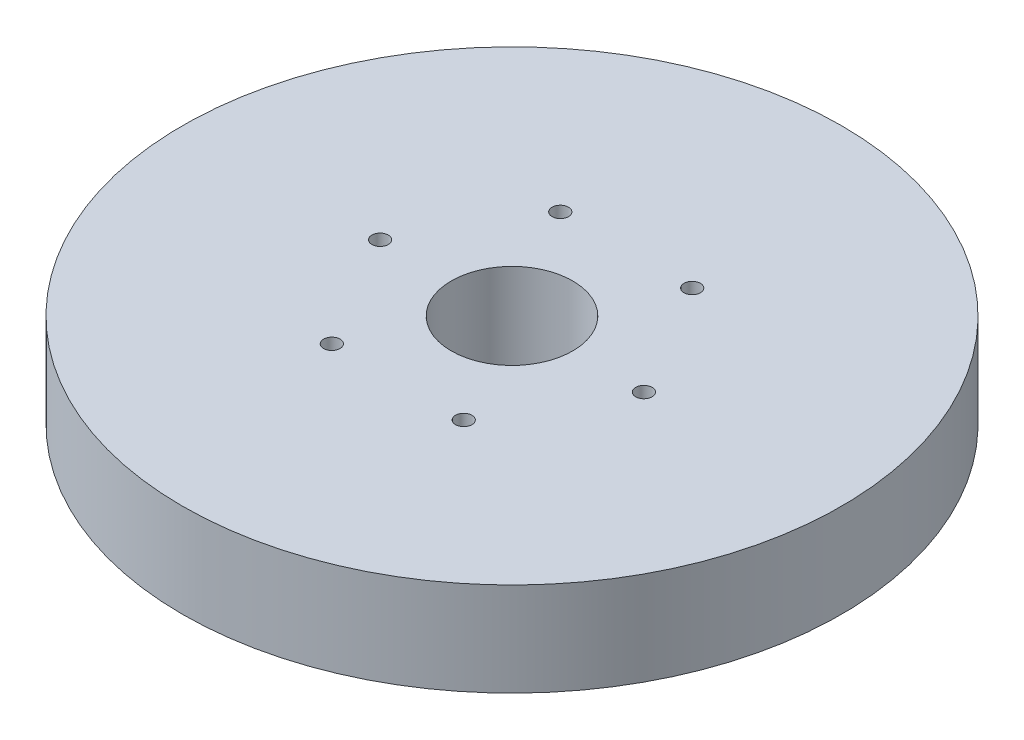
ISO-10303-21;
HEADER;
FILE_DESCRIPTION(('STEP AP214'),'2;1');
FILE_NAME('part.step','',(''),(''),'','','');
FILE_SCHEMA(('AUTOMOTIVE_DESIGN { 1 0 10303 214 1 1 1 1 }'));
ENDSEC;
DATA;
#1=APPLICATION_CONTEXT('core data for automotive mechanical design processes');
#2=APPLICATION_PROTOCOL_DEFINITION('international standard','automotive_design',2000,#1);
#3=PRODUCT_CONTEXT('',#1,'mechanical');
#4=PRODUCT('Part','Part','',(#3));
#5=PRODUCT_RELATED_PRODUCT_CATEGORY('part','',(#4));
#6=PRODUCT_DEFINITION_FORMATION('','',#4);
#7=PRODUCT_DEFINITION_CONTEXT('part definition',#1,'design');
#8=PRODUCT_DEFINITION('design','',#6,#7);
#9=PRODUCT_DEFINITION_SHAPE('','',#8);
#10=(LENGTH_UNIT() NAMED_UNIT(*) SI_UNIT(.MILLI.,.METRE.));
#11=(NAMED_UNIT(*) PLANE_ANGLE_UNIT() SI_UNIT($,.RADIAN.));
#12=(NAMED_UNIT(*) SI_UNIT($,.STERADIAN.) SOLID_ANGLE_UNIT());
#13=UNCERTAINTY_MEASURE_WITH_UNIT(LENGTH_MEASURE(1.E-05),#10,'distance_accuracy_value','');
#14=(GEOMETRIC_REPRESENTATION_CONTEXT(3) GLOBAL_UNCERTAINTY_ASSIGNED_CONTEXT((#13)) GLOBAL_UNIT_ASSIGNED_CONTEXT((#10,
#11,#12)) REPRESENTATION_CONTEXT('',''));
#15=CARTESIAN_POINT('',(0.,0.,0.));
#16=DIRECTION('',(0.,0.,1.));
#17=DIRECTION('',(1.,0.,0.));
#18=AXIS2_PLACEMENT_3D('',#15,#16,#17);
#19=CARTESIAN_POINT('',(0.,27.,0.));
#20=DIRECTION('',(0.,-1.,0.));
#21=DIRECTION('',(0.,0.,-1.));
#22=AXIS2_PLACEMENT_3D('',#19,#20,#21);
#23=CYLINDRICAL_SURFACE('',#22,95.);
#24=CARTESIAN_POINT('',(0.,27.,0.));
#25=DIRECTION('',(0.,1.,0.));
#26=DIRECTION('',(0.,0.,1.));
#27=AXIS2_PLACEMENT_3D('',#24,#25,#26);
#28=CIRCLE('',#27,95.);
#29=CARTESIAN_POINT('',(0.,27.,95.));
#30=VERTEX_POINT('',#29);
#31=EDGE_CURVE('E10',#30,#30,#28,.T.);
#32=ORIENTED_EDGE('',*,*,#31,.F.);
#33=EDGE_LOOP('',(#32));
#34=FACE_BOUND('',#33,.T.);
#35=CARTESIAN_POINT('',(0.,0.,0.));
#36=DIRECTION('',(0.,1.,0.));
#37=DIRECTION('',(0.,0.,1.));
#38=AXIS2_PLACEMENT_3D('',#35,#36,#37);
#39=CIRCLE('',#38,95.);
#40=CARTESIAN_POINT('',(0.,0.,95.));
#41=VERTEX_POINT('',#40);
#42=EDGE_CURVE('E37',#41,#41,#39,.T.);
#43=ORIENTED_EDGE('',*,*,#42,.T.);
#44=EDGE_LOOP('',(#43));
#45=FACE_BOUND('',#44,.T.);
#46=ADVANCED_FACE('F40',(#34,#45),#23,.T.);
#47=CARTESIAN_POINT('',(0.,27.,0.));
#48=DIRECTION('',(0.,1.,0.));
#49=DIRECTION('',(0.,0.,1.));
#50=AXIS2_PLACEMENT_3D('',#47,#48,#49);
#51=PLANE('',#50);
#52=CARTESIAN_POINT('',(-19.0119397928966,27.,-32.9296456717365));
#53=DIRECTION('',(0.,1.,0.));
#54=DIRECTION('',(-0.866025403784433,0.,0.50000000000001));
#55=AXIS2_PLACEMENT_3D('',#52,#53,#54);
#56=CIRCLE('',#55,2.36850058728825);
#57=CARTESIAN_POINT('',(-21.0631214703665,27.,-31.7453953780923));
#58=VERTEX_POINT('',#57);
#59=EDGE_CURVE('E70',#58,#58,#56,.T.);
#60=ORIENTED_EDGE('',*,*,#59,.F.);
#61=EDGE_LOOP('',(#60));
#62=FACE_BOUND('',#61,.T.);
#63=CARTESIAN_POINT('',(19.0119397928959,27.,-32.9296456717369));
#64=DIRECTION('',(0.,1.,0.));
#65=DIRECTION('',(-0.866025403784443,0.,-0.499999999999992));
#66=AXIS2_PLACEMENT_3D('',#63,#64,#65);
#67=CIRCLE('',#66,2.36850058728825);
#68=CARTESIAN_POINT('',(16.9607581154259,27.,-34.113895965381));
#69=VERTEX_POINT('',#68);
#70=EDGE_CURVE('E71',#69,#69,#67,.T.);
#71=ORIENTED_EDGE('',*,*,#70,.F.);
#72=EDGE_LOOP('',(#71));
#73=FACE_BOUND('',#72,.T.);
#74=CARTESIAN_POINT('',(38.0238795857924,27.,0.));
#75=DIRECTION('',(0.,1.,0.));
#76=DIRECTION('',(0.,0.,-1.));
#77=AXIS2_PLACEMENT_3D('',#74,#75,#76);
#78=CIRCLE('',#77,2.36850058728825);
#79=CARTESIAN_POINT('',(38.0238795857924,27.,-2.36850058728825));
#80=VERTEX_POINT('',#79);
#81=EDGE_CURVE('E78',#80,#80,#78,.T.);
#82=ORIENTED_EDGE('',*,*,#81,.F.);
#83=EDGE_LOOP('',(#82));
#84=FACE_BOUND('',#83,.T.);
#85=CARTESIAN_POINT('',(19.0119397928963,27.,32.9296456717366));
#86=DIRECTION('',(0.,1.,0.));
#87=DIRECTION('',(0.866025403784436,0.,-0.500000000000004));
#88=AXIS2_PLACEMENT_3D('',#85,#86,#87);
#89=CIRCLE('',#88,2.36850058728825);
#90=CARTESIAN_POINT('',(21.0631214703663,27.,31.7453953780925));
#91=VERTEX_POINT('',#90);
#92=EDGE_CURVE('E84',#91,#91,#89,.T.);
#93=ORIENTED_EDGE('',*,*,#92,.F.);
#94=EDGE_LOOP('',(#93));
#95=FACE_BOUND('',#94,.T.);
#96=CARTESIAN_POINT('',(-19.0119397928961,27.,32.9296456717367));
#97=DIRECTION('',(0.,1.,0.));
#98=DIRECTION('',(0.86602540378444,0.,0.499999999999998));
#99=AXIS2_PLACEMENT_3D('',#96,#97,#98);
#100=CIRCLE('',#99,2.36850058728825);
#101=CARTESIAN_POINT('',(-16.9607581154261,27.,34.1138959653809));
#102=VERTEX_POINT('',#101);
#103=EDGE_CURVE('E61',#102,#102,#100,.T.);
#104=ORIENTED_EDGE('',*,*,#103,.F.);
#105=EDGE_LOOP('',(#104));
#106=FACE_BOUND('',#105,.T.);
#107=CARTESIAN_POINT('',(-38.0238795857924,27.,0.));
#108=DIRECTION('',(0.,1.,0.));
#109=DIRECTION('',(0.,0.,1.));
#110=AXIS2_PLACEMENT_3D('',#107,#108,#109);
#111=CIRCLE('',#110,2.36850058728825);
#112=CARTESIAN_POINT('',(-38.0238795857924,27.,2.36850058728825));
#113=VERTEX_POINT('',#112);
#114=EDGE_CURVE('E54',#113,#113,#111,.T.);
#115=ORIENTED_EDGE('',*,*,#114,.F.);
#116=EDGE_LOOP('',(#115));
#117=FACE_BOUND('',#116,.T.);
#118=CARTESIAN_POINT('',(0.,27.,0.));
#119=DIRECTION('',(0.,1.,0.));
#120=DIRECTION('',(0.,0.,1.));
#121=AXIS2_PLACEMENT_3D('',#118,#119,#120);
#122=CIRCLE('',#121,17.5);
#123=CARTESIAN_POINT('',(0.,27.,17.5));
#124=VERTEX_POINT('',#123);
#125=EDGE_CURVE('E50',#124,#124,#122,.T.);
#126=ORIENTED_EDGE('',*,*,#125,.F.);
#127=EDGE_LOOP('',(#126));
#128=FACE_BOUND('',#127,.T.);
#129=ORIENTED_EDGE('',*,*,#31,.T.);
#130=EDGE_LOOP('',(#129));
#131=FACE_BOUND('',#130,.T.);
#132=ADVANCED_FACE('F99',(#62,#73,#84,#95,#106,#117,#128,#131),#51,.T.);
#133=CARTESIAN_POINT('',(0.,0.,0.));
#134=DIRECTION('',(0.,1.,0.));
#135=DIRECTION('',(0.,0.,1.));
#136=AXIS2_PLACEMENT_3D('',#133,#134,#135);
#137=PLANE('',#136);
#138=CARTESIAN_POINT('',(0.,0.,0.));
#139=DIRECTION('',(0.,1.,0.));
#140=DIRECTION('',(0.,0.,1.));
#141=AXIS2_PLACEMENT_3D('',#138,#139,#140);
#142=CIRCLE('',#141,17.5);
#143=CARTESIAN_POINT('',(0.,0.,17.5));
#144=VERTEX_POINT('',#143);
#145=EDGE_CURVE('E47',#144,#144,#142,.T.);
#146=ORIENTED_EDGE('',*,*,#145,.T.);
#147=EDGE_LOOP('',(#146));
#148=FACE_BOUND('',#147,.T.);
#149=ORIENTED_EDGE('',*,*,#42,.F.);
#150=EDGE_LOOP('',(#149));
#151=FACE_BOUND('',#150,.T.);
#152=ADVANCED_FACE('F103',(#148,#151),#137,.F.);
#153=CARTESIAN_POINT('',(0.,27.,0.));
#154=DIRECTION('',(0.,-1.,0.));
#155=DIRECTION('',(0.,0.,-1.));
#156=AXIS2_PLACEMENT_3D('',#153,#154,#155);
#157=CYLINDRICAL_SURFACE('',#156,17.5);
#158=ORIENTED_EDGE('',*,*,#125,.T.);
#159=EDGE_LOOP('',(#158));
#160=FACE_BOUND('',#159,.T.);
#161=ORIENTED_EDGE('',*,*,#145,.F.);
#162=EDGE_LOOP('',(#161));
#163=FACE_BOUND('',#162,.T.);
#164=ADVANCED_FACE('F115',(#160,#163),#157,.F.);
#165=CARTESIAN_POINT('',(-38.0238795857924,10.2041194303289,0.));
#166=DIRECTION('',(0.,1.,0.));
#167=DIRECTION('',(0.,0.,1.));
#168=AXIS2_PLACEMENT_3D('',#165,#166,#167);
#169=CYLINDRICAL_SURFACE('',#168,2.36850058728825);
#170=CARTESIAN_POINT('',(-38.0238795857924,10.2041194303289,0.));
#171=DIRECTION('',(0.,1.,0.));
#172=DIRECTION('',(0.,0.,1.));
#173=AXIS2_PLACEMENT_3D('',#170,#171,#172);
#174=CIRCLE('',#173,2.36850058728825);
#175=CARTESIAN_POINT('',(-38.0238795857924,10.2041194303289,2.36850058728825));
#176=VERTEX_POINT('',#175);
#177=EDGE_CURVE('E55',#176,#176,#174,.T.);
#178=ORIENTED_EDGE('',*,*,#177,.F.);
#179=EDGE_LOOP('',(#178));
#180=FACE_BOUND('',#179,.T.);
#181=ORIENTED_EDGE('',*,*,#114,.T.);
#182=EDGE_LOOP('',(#181));
#183=FACE_BOUND('',#182,.T.);
#184=ADVANCED_FACE('F113',(#180,#183),#169,.F.);
#185=CARTESIAN_POINT('',(-38.0238795857924,10.2041194303289,0.));
#186=DIRECTION('',(0.,1.,0.));
#187=DIRECTION('',(0.,0.,1.));
#188=AXIS2_PLACEMENT_3D('',#185,#186,#187);
#189=PLANE('',#188);
#190=ORIENTED_EDGE('',*,*,#177,.T.);
#191=EDGE_LOOP('',(#190));
#192=FACE_BOUND('',#191,.T.);
#193=ADVANCED_FACE('F144',(#192),#189,.T.);
#194=CARTESIAN_POINT('',(-19.0119397928961,10.2041194303289,32.9296456717367));
#195=DIRECTION('',(0.,1.,0.));
#196=DIRECTION('',(0.,0.,1.));
#197=AXIS2_PLACEMENT_3D('',#194,#195,#196);
#198=CYLINDRICAL_SURFACE('',#197,2.36850058728825);
#199=CARTESIAN_POINT('',(-19.0119397928961,10.2041194303289,32.9296456717367));
#200=DIRECTION('',(0.,1.,0.));
#201=DIRECTION('',(0.86602540378444,0.,0.499999999999998));
#202=AXIS2_PLACEMENT_3D('',#199,#200,#201);
#203=CIRCLE('',#202,2.36850058728825);
#204=CARTESIAN_POINT('',(-16.9607581154261,10.2041194303289,34.1138959653809));
#205=VERTEX_POINT('',#204);
#206=EDGE_CURVE('E59',#205,#205,#203,.T.);
#207=ORIENTED_EDGE('',*,*,#206,.F.);
#208=EDGE_LOOP('',(#207));
#209=FACE_BOUND('',#208,.T.);
#210=ORIENTED_EDGE('',*,*,#103,.T.);
#211=EDGE_LOOP('',(#210));
#212=FACE_BOUND('',#211,.T.);
#213=ADVANCED_FACE('F153',(#209,#212),#198,.F.);
#214=CARTESIAN_POINT('',(-19.0119397928961,10.2041194303289,32.9296456717367));
#215=DIRECTION('',(0.,1.,0.));
#216=DIRECTION('',(0.86602540378444,0.,0.499999999999998));
#217=AXIS2_PLACEMENT_3D('',#214,#215,#216);
#218=PLANE('',#217);
#219=ORIENTED_EDGE('',*,*,#206,.T.);
#220=EDGE_LOOP('',(#219));
#221=FACE_BOUND('',#220,.T.);
#222=ADVANCED_FACE('F96',(#221),#218,.T.);
#223=CARTESIAN_POINT('',(19.0119397928963,10.2041194303289,32.9296456717366));
#224=DIRECTION('',(0.,1.,0.));
#225=DIRECTION('',(0.,0.,1.));
#226=AXIS2_PLACEMENT_3D('',#223,#224,#225);
#227=CYLINDRICAL_SURFACE('',#226,2.36850058728825);
#228=CARTESIAN_POINT('',(19.0119397928963,10.2041194303289,32.9296456717366));
#229=DIRECTION('',(0.,1.,0.));
#230=DIRECTION('',(0.866025403784436,0.,-0.500000000000004));
#231=AXIS2_PLACEMENT_3D('',#228,#229,#230);
#232=CIRCLE('',#231,2.36850058728825);
#233=CARTESIAN_POINT('',(21.0631214703663,10.2041194303289,31.7453953780925));
#234=VERTEX_POINT('',#233);
#235=EDGE_CURVE('E63',#234,#234,#232,.T.);
#236=ORIENTED_EDGE('',*,*,#235,.F.);
#237=EDGE_LOOP('',(#236));
#238=FACE_BOUND('',#237,.T.);
#239=ORIENTED_EDGE('',*,*,#92,.T.);
#240=EDGE_LOOP('',(#239));
#241=FACE_BOUND('',#240,.T.);
#242=ADVANCED_FACE('F91',(#238,#241),#227,.F.);
#243=CARTESIAN_POINT('',(19.0119397928963,10.2041194303289,32.9296456717366));
#244=DIRECTION('',(0.,1.,0.));
#245=DIRECTION('',(0.866025403784436,0.,-0.500000000000004));
#246=AXIS2_PLACEMENT_3D('',#243,#244,#245);
#247=PLANE('',#246);
#248=ORIENTED_EDGE('',*,*,#235,.T.);
#249=EDGE_LOOP('',(#248));
#250=FACE_BOUND('',#249,.T.);
#251=ADVANCED_FACE('F93',(#250),#247,.T.);
#252=CARTESIAN_POINT('',(38.0238795857924,10.2041194303289,0.));
#253=DIRECTION('',(0.,1.,0.));
#254=DIRECTION('',(0.,0.,1.));
#255=AXIS2_PLACEMENT_3D('',#252,#253,#254);
#256=CYLINDRICAL_SURFACE('',#255,2.36850058728825);
#257=CARTESIAN_POINT('',(38.0238795857924,10.2041194303289,0.));
#258=DIRECTION('',(0.,1.,0.));
#259=DIRECTION('',(0.,0.,-1.));
#260=AXIS2_PLACEMENT_3D('',#257,#258,#259);
#261=CIRCLE('',#260,2.36850058728825);
#262=CARTESIAN_POINT('',(38.0238795857924,10.2041194303289,-2.36850058728825));
#263=VERTEX_POINT('',#262);
#264=EDGE_CURVE('E85',#263,#263,#261,.T.);
#265=ORIENTED_EDGE('',*,*,#264,.F.);
#266=EDGE_LOOP('',(#265));
#267=FACE_BOUND('',#266,.T.);
#268=ORIENTED_EDGE('',*,*,#81,.T.);
#269=EDGE_LOOP('',(#268));
#270=FACE_BOUND('',#269,.T.);
#271=ADVANCED_FACE('F187',(#267,#270),#256,.F.);
#272=CARTESIAN_POINT('',(38.0238795857924,10.2041194303289,0.));
#273=DIRECTION('',(0.,1.,0.));
#274=DIRECTION('',(0.,0.,-1.));
#275=AXIS2_PLACEMENT_3D('',#272,#273,#274);
#276=PLANE('',#275);
#277=ORIENTED_EDGE('',*,*,#264,.T.);
#278=EDGE_LOOP('',(#277));
#279=FACE_BOUND('',#278,.T.);
#280=ADVANCED_FACE('F198',(#279),#276,.T.);
#281=CARTESIAN_POINT('',(19.0119397928959,10.2041194303289,-32.9296456717369));
#282=DIRECTION('',(0.,1.,0.));
#283=DIRECTION('',(0.,0.,1.));
#284=AXIS2_PLACEMENT_3D('',#281,#282,#283);
#285=CYLINDRICAL_SURFACE('',#284,2.36850058728825);
#286=CARTESIAN_POINT('',(19.0119397928959,10.2041194303289,-32.9296456717369));
#287=DIRECTION('',(0.,1.,0.));
#288=DIRECTION('',(-0.866025403784443,0.,-0.499999999999992));
#289=AXIS2_PLACEMENT_3D('',#286,#287,#288);
#290=CIRCLE('',#289,2.36850058728825);
#291=CARTESIAN_POINT('',(16.9607581154259,10.2041194303289,-34.113895965381));
#292=VERTEX_POINT('',#291);
#293=EDGE_CURVE('E76',#292,#292,#290,.T.);
#294=ORIENTED_EDGE('',*,*,#293,.F.);
#295=EDGE_LOOP('',(#294));
#296=FACE_BOUND('',#295,.T.);
#297=ORIENTED_EDGE('',*,*,#70,.T.);
#298=EDGE_LOOP('',(#297));
#299=FACE_BOUND('',#298,.T.);
#300=ADVANCED_FACE('F202',(#296,#299),#285,.F.);
#301=CARTESIAN_POINT('',(19.0119397928959,10.2041194303289,-32.9296456717369));
#302=DIRECTION('',(0.,1.,0.));
#303=DIRECTION('',(-0.866025403784443,0.,-0.499999999999992));
#304=AXIS2_PLACEMENT_3D('',#301,#302,#303);
#305=PLANE('',#304);
#306=ORIENTED_EDGE('',*,*,#293,.T.);
#307=EDGE_LOOP('',(#306));
#308=FACE_BOUND('',#307,.T.);
#309=ADVANCED_FACE('F212',(#308),#305,.T.);
#310=CARTESIAN_POINT('',(-19.0119397928966,10.2041194303289,-32.9296456717365));
#311=DIRECTION('',(0.,1.,0.));
#312=DIRECTION('',(0.,0.,1.));
#313=AXIS2_PLACEMENT_3D('',#310,#311,#312);
#314=CYLINDRICAL_SURFACE('',#313,2.36850058728825);
#315=CARTESIAN_POINT('',(-19.0119397928966,10.2041194303289,-32.9296456717365));
#316=DIRECTION('',(0.,1.,0.));
#317=DIRECTION('',(-0.866025403784433,0.,0.50000000000001));
#318=AXIS2_PLACEMENT_3D('',#315,#316,#317);
#319=CIRCLE('',#318,2.36850058728825);
#320=CARTESIAN_POINT('',(-21.0631214703665,10.2041194303289,-31.7453953780923));
#321=VERTEX_POINT('',#320);
#322=EDGE_CURVE('E69',#321,#321,#319,.T.);
#323=ORIENTED_EDGE('',*,*,#322,.F.);
#324=EDGE_LOOP('',(#323));
#325=FACE_BOUND('',#324,.T.);
#326=ORIENTED_EDGE('',*,*,#59,.T.);
#327=EDGE_LOOP('',(#326));
#328=FACE_BOUND('',#327,.T.);
#329=ADVANCED_FACE('F224',(#325,#328),#314,.F.);
#330=CARTESIAN_POINT('',(-19.0119397928966,10.2041194303289,-32.9296456717365));
#331=DIRECTION('',(0.,1.,0.));
#332=DIRECTION('',(-0.866025403784433,0.,0.50000000000001));
#333=AXIS2_PLACEMENT_3D('',#330,#331,#332);
#334=PLANE('',#333);
#335=ORIENTED_EDGE('',*,*,#322,.T.);
#336=EDGE_LOOP('',(#335));
#337=FACE_BOUND('',#336,.T.);
#338=ADVANCED_FACE('F235',(#337),#334,.T.);
#339=CLOSED_SHELL('',(#46,#132,#152,#164,#184,#193,#213,#222,#242,#251,#271,#280,#300,#309,#329,#338));
#340=MANIFOLD_SOLID_BREP('B2',#339);
#341=ADVANCED_BREP_SHAPE_REPRESENTATION('',(#18,#340),#14);
#342=SHAPE_DEFINITION_REPRESENTATION(#9,#341);
ENDSEC;
END-ISO-10303-21;
